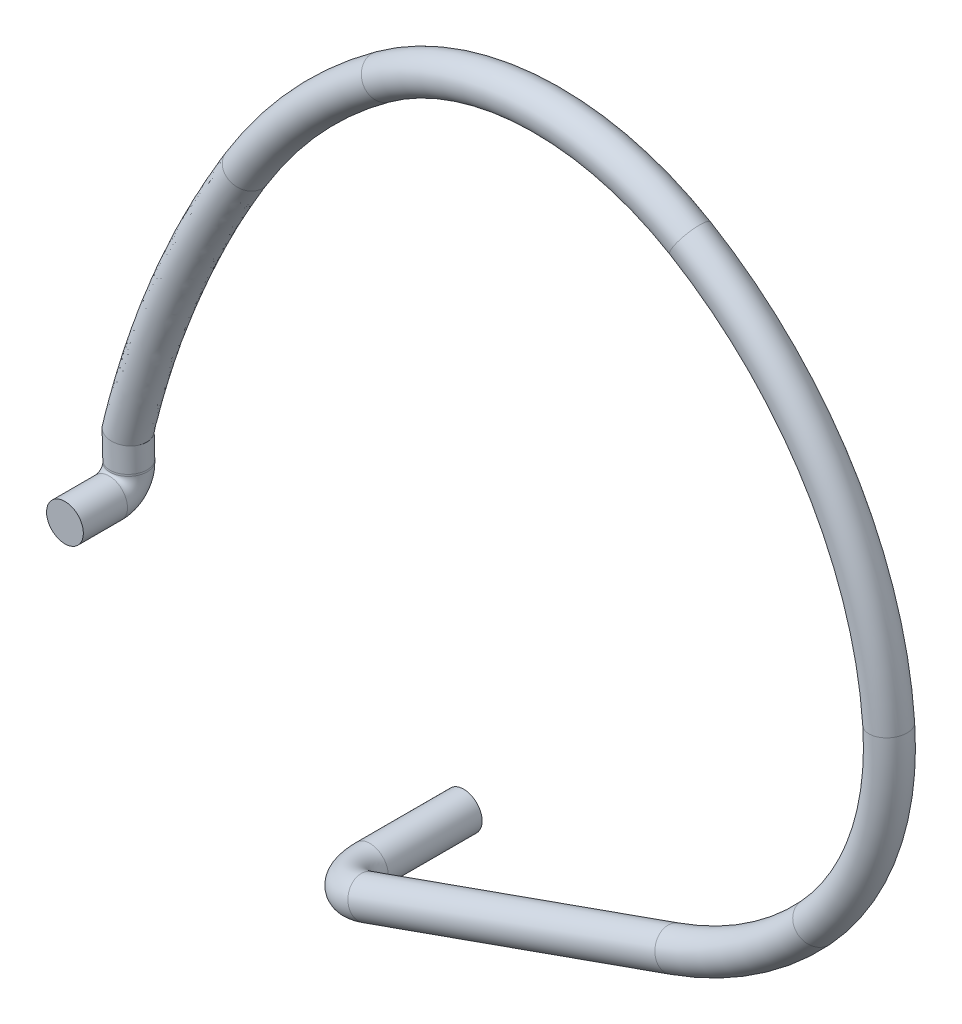
ISO-10303-21;
HEADER;
FILE_DESCRIPTION(('STEP AP214'),'2;1');
FILE_NAME('part.step','',(''),(''),'','','');
FILE_SCHEMA(('AUTOMOTIVE_DESIGN { 1 0 10303 214 1 1 1 1 }'));
ENDSEC;
DATA;
#1=APPLICATION_CONTEXT('core data for automotive mechanical design processes');
#2=APPLICATION_PROTOCOL_DEFINITION('international standard','automotive_design',2000,#1);
#3=PRODUCT_CONTEXT('',#1,'mechanical');
#4=PRODUCT('Part','Part','',(#3));
#5=PRODUCT_RELATED_PRODUCT_CATEGORY('part','',(#4));
#6=PRODUCT_DEFINITION_FORMATION('','',#4);
#7=PRODUCT_DEFINITION_CONTEXT('part definition',#1,'design');
#8=PRODUCT_DEFINITION('design','',#6,#7);
#9=PRODUCT_DEFINITION_SHAPE('','',#8);
#10=(LENGTH_UNIT() NAMED_UNIT(*) SI_UNIT(.MILLI.,.METRE.));
#11=(NAMED_UNIT(*) PLANE_ANGLE_UNIT() SI_UNIT($,.RADIAN.));
#12=(NAMED_UNIT(*) SI_UNIT($,.STERADIAN.) SOLID_ANGLE_UNIT());
#13=UNCERTAINTY_MEASURE_WITH_UNIT(LENGTH_MEASURE(1.E-05),#10,'distance_accuracy_value','');
#14=(GEOMETRIC_REPRESENTATION_CONTEXT(3) GLOBAL_UNCERTAINTY_ASSIGNED_CONTEXT((#13)) GLOBAL_UNIT_ASSIGNED_CONTEXT((#10,
#11,#12)) REPRESENTATION_CONTEXT('',''));
#15=CARTESIAN_POINT('',(0.,0.,0.));
#16=DIRECTION('',(0.,0.,1.));
#17=DIRECTION('',(1.,0.,0.));
#18=AXIS2_PLACEMENT_3D('',#15,#16,#17);
#19=CARTESIAN_POINT('',(-1.26943375651146,1.19294107246248,0.110000000000001));
#20=DIRECTION('',(0.,0.,1.));
#21=DIRECTION('',(1.,0.,0.));
#22=AXIS2_PLACEMENT_3D('',#19,#20,#21);
#23=CYLINDRICAL_SURFACE('',#22,0.0999999999999978);
#24=CARTESIAN_POINT('',(-1.26943375651146,1.19294107246248,0.110000000000001));
#25=DIRECTION('',(0.,0.,-1.));
#26=DIRECTION('',(-0.999662443856908,-0.0259807302059508,0.));
#27=AXIS2_PLACEMENT_3D('',#24,#25,#26);
#28=CIRCLE('',#27,0.0999999999999978);
#29=CARTESIAN_POINT('',(-1.26683568349087,1.09297482807679,0.110000000000002));
#30=VERTEX_POINT('',#29);
#31=EDGE_CURVE('E42',#30,#30,#28,.T.);
#32=ORIENTED_EDGE('',*,*,#31,.F.);
#33=EDGE_LOOP('',(#32));
#34=FACE_BOUND('',#33,.T.);
#35=CARTESIAN_POINT('',(-1.26943375651146,1.19294107246248,0.35));
#36=DIRECTION('',(0.,0.,-1.));
#37=DIRECTION('',(-0.999662443856908,-0.0259807302059508,0.));
#38=AXIS2_PLACEMENT_3D('',#35,#36,#37);
#39=CIRCLE('',#38,0.0999999999999978);
#40=CARTESIAN_POINT('',(-1.36940000089715,1.19034299944188,0.35));
#41=VERTEX_POINT('',#40);
#42=EDGE_CURVE('E11',#41,#41,#39,.T.);
#43=ORIENTED_EDGE('',*,*,#42,.T.);
#44=EDGE_LOOP('',(#43));
#45=FACE_BOUND('',#44,.T.);
#46=ADVANCED_FACE('F36',(#34,#45),#23,.T.);
#47=CARTESIAN_POINT('',(-1.27229461323826,1.30301846460529,0.11));
#48=DIRECTION('',(-0.999662443856908,-0.0259807302059508,0.));
#49=DIRECTION('',(0.0259807302059508,-0.999662443856908,0.));
#50=AXIS2_PLACEMENT_3D('',#47,#48,#49);
#51=TOROIDAL_SURFACE('',#50,0.110114561989662,0.0999999999999978);
#52=CARTESIAN_POINT('',(-1.27229461323826,1.3030184646053,-0.000114561989662156));
#53=DIRECTION('',(-0.0259807302059495,0.999662443856908,0.));
#54=DIRECTION('',(-0.999662443856908,-0.0259807302059495,0.));
#55=AXIS2_PLACEMENT_3D('',#52,#53,#54);
#56=CIRCLE('',#55,0.0999999999999978);
#57=CARTESIAN_POINT('',(-1.27229461323826,1.3030184646053,-0.10011456198966));
#58=VERTEX_POINT('',#57);
#59=EDGE_CURVE('E46',#58,#58,#56,.T.);
#60=CARTESIAN_POINT('',(-1.27229461323826,1.30301846460529,0.11));
#61=DIRECTION('',(-0.999662443856908,-0.0259807302059508,0.));
#62=DIRECTION('',(0.0259807302059508,-0.999662443856908,0.));
#63=AXIS2_PLACEMENT_3D('',#60,#61,#62);
#64=CIRCLE('',#63,0.21011456198966);
#65=EDGE_CURVE('',#58,#30,#64,.T.);
#66=ORIENTED_EDGE('',*,*,#59,.F.);
#67=ORIENTED_EDGE('',*,*,#31,.T.);
#68=ORIENTED_EDGE('',*,*,#65,.T.);
#69=ORIENTED_EDGE('',*,*,#65,.F.);
#70=EDGE_LOOP('',(#66,#68,#67,#69));
#71=FACE_BOUND('',#70,.T.);
#72=ADVANCED_FACE('F97',(#71),#51,.T.);
#73=CARTESIAN_POINT('',(-1.27253634184482,1.31231947376339,-0.000114561989662061));
#74=DIRECTION('',(0.0259807302059614,-0.999662443856908,0.));
#75=DIRECTION('',(0.999662443856908,0.0259807302059614,0.));
#76=AXIS2_PLACEMENT_3D('',#73,#74,#75);
#77=CYLINDRICAL_SURFACE('',#76,0.0999999999999978);
#78=CARTESIAN_POINT('',(-1.27253634184482,1.31231947376339,-0.000114561989662061));
#79=DIRECTION('',(-0.0259807302059495,0.999662443856908,0.));
#80=DIRECTION('',(-0.999662443856908,-0.0259807302059495,0.));
#81=AXIS2_PLACEMENT_3D('',#78,#79,#80);
#82=CIRCLE('',#81,0.0999999999999978);
#83=CARTESIAN_POINT('',(-1.37250258623051,1.30972140074279,-0.000114561989662061));
#84=VERTEX_POINT('',#83);
#85=EDGE_CURVE('E84',#84,#84,#82,.T.);
#86=ORIENTED_EDGE('',*,*,#85,.F.);
#87=EDGE_LOOP('',(#86));
#88=FACE_BOUND('',#87,.T.);
#89=ORIENTED_EDGE('',*,*,#59,.T.);
#90=EDGE_LOOP('',(#89));
#91=FACE_BOUND('',#90,.T.);
#92=ADVANCED_FACE('F93',(#88,#91),#77,.T.);
#93=CARTESIAN_POINT('',(1.75401515880903,1.53999070756492,-0.000114561989662061));
#94=DIRECTION('',(0.,0.,1.));
#95=DIRECTION('',(1.,0.,0.));
#96=AXIS2_PLACEMENT_3D('',#93,#94,#95);
#97=TOROIDAL_SURFACE('',#96,2.80000000000356,0.1);
#98=CARTESIAN_POINT('',(0.107557611958515,3.80475946980951,-0.000114561989662061));
#99=DIRECTION('',(0.808845986513773,0.588020552447413,0.));
#100=DIRECTION('',(0.196440073807942,-0.270211244536807,0.942548237878677));
#101=AXIS2_PLACEMENT_3D('',#98,#99,#100);
#102=CIRCLE('',#101,0.1);
#103=CARTESIAN_POINT('',(0.0487555567139279,3.885644068461,-0.000114561989662061));
#104=VERTEX_POINT('',#103);
#105=EDGE_CURVE('E50',#104,#104,#102,.T.);
#106=CARTESIAN_POINT('',(-0.633159127096336,3.00334265727904,-0.000114561989662061));
#107=DIRECTION('',(0.522625696324177,0.852562244966119,0.));
#108=DIRECTION('',(0.284815538555503,-0.174593608901182,0.942548237878677));
#109=AXIS2_PLACEMENT_3D('',#106,#107,#108);
#110=CIRCLE('',#109,0.1);
#111=CARTESIAN_POINT('',(-0.718415351592848,3.05560522691162,-0.000114561989662061));
#112=VERTEX_POINT('',#111);
#113=EDGE_CURVE('E74',#112,#112,#110,.T.);
#114=CARTESIAN_POINT('',(1.75401515880903,1.53999070756492,-0.000114561989662061));
#115=DIRECTION('',(0.,0.,1.));
#116=DIRECTION('',(1.,0.,0.));
#117=AXIS2_PLACEMENT_3D('',#114,#115,#116);
#118=CIRCLE('',#117,2.90000000000356);
#119=EDGE_CURVE('',#104,#112,#118,.T.);
#120=ORIENTED_EDGE('',*,*,#105,.F.);
#121=ORIENTED_EDGE('',*,*,#113,.T.);
#122=ORIENTED_EDGE('',*,*,#119,.T.);
#123=ORIENTED_EDGE('',*,*,#119,.F.);
#124=EDGE_LOOP('',(#120,#122,#121,#123));
#125=FACE_BOUND('',#124,.T.);
#126=ADVANCED_FACE('F96',(#125),#97,.T.);
#127=CARTESIAN_POINT('',(1.00134885167629,2.57531357030678,-0.000114561989662061));
#128=DIRECTION('',(0.,0.,1.));
#129=DIRECTION('',(1.,0.,0.));
#130=AXIS2_PLACEMENT_3D('',#127,#128,#129);
#131=TOROIDAL_SURFACE('',#130,1.5200000000001,0.1);
#132=CARTESIAN_POINT('',(1.77802987975059,3.88189941923894,-0.000114561989662061));
#133=DIRECTION('',(0.85959595324576,-0.510974360573516,0.));
#134=DIRECTION('',(-0.170701246218798,-0.287165290052871,0.942548237878677));
#135=AXIS2_PLACEMENT_3D('',#132,#133,#134);
#136=CIRCLE('',#135,0.1);
#137=CARTESIAN_POINT('',(1.82912731580811,3.96785901456341,-0.000114561989662061));
#138=VERTEX_POINT('',#137);
#139=EDGE_CURVE('E55',#138,#138,#136,.T.);
#140=CARTESIAN_POINT('',(1.00134885167629,2.57531357030678,-0.000114561989662061));
#141=DIRECTION('',(0.,0.,1.));
#142=DIRECTION('',(1.,0.,0.));
#143=AXIS2_PLACEMENT_3D('',#140,#141,#142);
#144=CIRCLE('',#143,1.6200000000001);
#145=EDGE_CURVE('',#138,#104,#144,.T.);
#146=ORIENTED_EDGE('',*,*,#139,.F.);
#147=ORIENTED_EDGE('',*,*,#105,.T.);
#148=ORIENTED_EDGE('',*,*,#145,.T.);
#149=ORIENTED_EDGE('',*,*,#145,.F.);
#150=EDGE_LOOP('',(#146,#148,#147,#149));
#151=FACE_BOUND('',#150,.T.);
#152=ADVANCED_FACE('F109',(#151),#131,.T.);
#153=CARTESIAN_POINT('',(0.643666799274295,1.97359640302815,-0.000114561989662061));
#154=DIRECTION('',(0.,0.,1.));
#155=DIRECTION('',(1.,0.,0.));
#156=AXIS2_PLACEMENT_3D('',#153,#154,#155);
#157=TOROIDAL_SURFACE('',#156,2.22000000000604,0.1);
#158=CARTESIAN_POINT('',(2.85785457566425,2.13413453218178,-0.000114561989662061));
#159=DIRECTION('',(0.0723144725915277,-0.997381881254021,0.));
#160=DIRECTION('',(-0.33319544623532,-0.0241581017434347,0.942548237878677));
#161=AXIS2_PLACEMENT_3D('',#158,#159,#160);
#162=CIRCLE('',#161,0.1);
#163=CARTESIAN_POINT('',(2.95759276378965,2.14136597944094,-0.000114561989662061));
#164=VERTEX_POINT('',#163);
#165=EDGE_CURVE('E58',#164,#164,#162,.T.);
#166=CARTESIAN_POINT('',(0.643666799274295,1.97359640302815,-0.000114561989662061));
#167=DIRECTION('',(0.,0.,1.));
#168=DIRECTION('',(1.,0.,0.));
#169=AXIS2_PLACEMENT_3D('',#166,#167,#168);
#170=CIRCLE('',#169,2.32000000000604);
#171=EDGE_CURVE('',#164,#138,#170,.T.);
#172=ORIENTED_EDGE('',*,*,#165,.F.);
#173=ORIENTED_EDGE('',*,*,#139,.T.);
#174=ORIENTED_EDGE('',*,*,#171,.T.);
#175=ORIENTED_EDGE('',*,*,#171,.F.);
#176=EDGE_LOOP('',(#172,#174,#173,#175));
#177=FACE_BOUND('',#176,.T.);
#178=ADVANCED_FACE('F113',(#177),#157,.T.);
#179=CARTESIAN_POINT('',(1.35180793496933,2.02493967856848,-0.000114561989662061));
#180=DIRECTION('',(0.,0.,1.));
#181=DIRECTION('',(1.,0.,0.));
#182=AXIS2_PLACEMENT_3D('',#179,#180,#181);
#183=TOROIDAL_SURFACE('',#182,1.51000000000135,0.1);
#184=CARTESIAN_POINT('',(2.46011325804326,0.999386505471118,-0.000114561989662061));
#185=DIRECTION('',(-0.679174286818835,-0.733977035147645,0.));
#186=DIRECTION('',(-0.245199767861234,0.226891809267318,0.942548237878677));
#187=AXIS2_PLACEMENT_3D('',#184,#185,#186);
#188=CIRCLE('',#187,0.1);
#189=CARTESIAN_POINT('',(2.53351096155803,0.931469076789235,-0.000114561989662061));
#190=VERTEX_POINT('',#189);
#191=EDGE_CURVE('E61',#190,#190,#188,.T.);
#192=CARTESIAN_POINT('',(1.35180793496933,2.02493967856848,-0.000114561989662061));
#193=DIRECTION('',(0.,0.,1.));
#194=DIRECTION('',(1.,0.,0.));
#195=AXIS2_PLACEMENT_3D('',#192,#193,#194);
#196=CIRCLE('',#195,1.61000000000135);
#197=EDGE_CURVE('',#190,#164,#196,.T.);
#198=ORIENTED_EDGE('',*,*,#191,.F.);
#199=ORIENTED_EDGE('',*,*,#165,.T.);
#200=ORIENTED_EDGE('',*,*,#197,.T.);
#201=ORIENTED_EDGE('',*,*,#197,.F.);
#202=EDGE_LOOP('',(#198,#200,#199,#201));
#203=FACE_BOUND('',#202,.T.);
#204=ADVANCED_FACE('F117',(#203),#183,.T.);
#205=CARTESIAN_POINT('',(1.05087735055879,2.3034011361642,-0.000114561989662061));
#206=DIRECTION('',(0.,0.,1.));
#207=DIRECTION('',(1.,0.,0.));
#208=AXIS2_PLACEMENT_3D('',#205,#206,#207);
#209=TOROIDAL_SURFACE('',#208,1.92000000000135,0.1);
#210=CARTESIAN_POINT('',(1.69229190680471,0.493708519435864,-0.000114561989662061));
#211=DIRECTION('',(-0.942548237878677,-0.334070081377845,0.));
#212=DIRECTION('',(-0.111602819271788,0.314877166530679,0.942548237878677));
#213=AXIS2_PLACEMENT_3D('',#210,#211,#212);
#214=CIRCLE('',#213,0.1);
#215=CARTESIAN_POINT('',(1.72569891494249,0.399453695647997,-0.000114561989662061));
#216=VERTEX_POINT('',#215);
#217=EDGE_CURVE('E64',#216,#216,#214,.T.);
#218=CARTESIAN_POINT('',(1.05087735055879,2.3034011361642,-0.000114561989662061));
#219=DIRECTION('',(0.,0.,1.));
#220=DIRECTION('',(1.,0.,0.));
#221=AXIS2_PLACEMENT_3D('',#218,#219,#220);
#222=CIRCLE('',#221,2.02000000000135);
#223=EDGE_CURVE('',#216,#190,#222,.T.);
#224=ORIENTED_EDGE('',*,*,#217,.F.);
#225=ORIENTED_EDGE('',*,*,#191,.T.);
#226=ORIENTED_EDGE('',*,*,#223,.T.);
#227=ORIENTED_EDGE('',*,*,#223,.F.);
#228=EDGE_LOOP('',(#224,#226,#225,#227));
#229=FACE_BOUND('',#228,.T.);
#230=ADVANCED_FACE('F121',(#229),#209,.T.);
#231=CARTESIAN_POINT('',(0.0239815257589993,-0.0975955246016457,-0.000114561989662061));
#232=DIRECTION('',(0.942548237878677,0.334070081377848,0.));
#233=DIRECTION('',(-0.334070081377848,0.942548237878677,0.));
#234=AXIS2_PLACEMENT_3D('',#231,#232,#233);
#235=CYLINDRICAL_SURFACE('',#234,0.1);
#236=CARTESIAN_POINT('',(0.0239815257589993,-0.0975955246016457,-0.000114561989662061));
#237=DIRECTION('',(-0.942548237878677,-0.334070081377845,0.));
#238=DIRECTION('',(-0.111602819271788,0.314877166530679,0.942548237878677));
#239=AXIS2_PLACEMENT_3D('',#236,#237,#238);
#240=CIRCLE('',#239,0.1);
#241=CARTESIAN_POINT('',(0.023981525759,-0.0975955246016454,0.099885438010338));
#242=VERTEX_POINT('',#241);
#243=EDGE_CURVE('E67',#242,#242,#240,.T.);
#244=ORIENTED_EDGE('',*,*,#243,.F.);
#245=EDGE_LOOP('',(#244));
#246=FACE_BOUND('',#245,.T.);
#247=ORIENTED_EDGE('',*,*,#217,.T.);
#248=EDGE_LOOP('',(#247));
#249=FACE_BOUND('',#248,.T.);
#250=ADVANCED_FACE('F125',(#246,#249),#235,.T.);
#251=CARTESIAN_POINT('',(0.0239815257589978,-0.0975955246016462,-0.24));
#252=DIRECTION('',(-0.334070081377845,0.942548237878677,0.));
#253=DIRECTION('',(-0.942548237878677,-0.334070081377845,0.));
#254=AXIS2_PLACEMENT_3D('',#251,#252,#253);
#255=TOROIDAL_SURFACE('',#254,0.239885438010338,0.1);
#256=CARTESIAN_POINT('',(-0.202122071130401,-0.17773407239912,-0.240000000000002));
#257=DIRECTION('',(0.,0.,-1.));
#258=DIRECTION('',(-1.,0.,0.));
#259=AXIS2_PLACEMENT_3D('',#256,#257,#258);
#260=CIRCLE('',#259,0.1);
#261=CARTESIAN_POINT('',(-0.296376894918269,-0.211141080536904,-0.240000000000002));
#262=VERTEX_POINT('',#261);
#263=EDGE_CURVE('E70',#262,#262,#260,.T.);
#264=CARTESIAN_POINT('',(0.0239815257589978,-0.0975955246016462,-0.24));
#265=DIRECTION('',(-0.334070081377845,0.942548237878677,0.));
#266=DIRECTION('',(-0.942548237878677,-0.334070081377845,0.));
#267=AXIS2_PLACEMENT_3D('',#264,#265,#266);
#268=CIRCLE('',#267,0.339885438010338);
#269=EDGE_CURVE('',#262,#242,#268,.T.);
#270=ORIENTED_EDGE('',*,*,#263,.F.);
#271=ORIENTED_EDGE('',*,*,#243,.T.);
#272=ORIENTED_EDGE('',*,*,#269,.T.);
#273=ORIENTED_EDGE('',*,*,#269,.F.);
#274=EDGE_LOOP('',(#270,#272,#271,#273));
#275=FACE_BOUND('',#274,.T.);
#276=ADVANCED_FACE('F129',(#275),#255,.T.);
#277=CARTESIAN_POINT('',(-0.202122071130401,-0.17773407239912,-0.240000000000002));
#278=DIRECTION('',(0.,0.,-1.));
#279=DIRECTION('',(-1.,0.,0.));
#280=AXIS2_PLACEMENT_3D('',#277,#278,#279);
#281=CYLINDRICAL_SURFACE('',#280,0.1);
#282=ORIENTED_EDGE('',*,*,#263,.T.);
#283=EDGE_LOOP('',(#282));
#284=FACE_BOUND('',#283,.T.);
#285=CARTESIAN_POINT('',(-0.202122071130401,-0.17773407239912,-0.75));
#286=DIRECTION('',(0.,0.,-1.));
#287=DIRECTION('',(-1.,0.,0.));
#288=AXIS2_PLACEMENT_3D('',#285,#286,#287);
#289=CIRCLE('',#288,0.1);
#290=CARTESIAN_POINT('',(-0.302122071130401,-0.17773407239912,-0.75));
#291=VERTEX_POINT('',#290);
#292=EDGE_CURVE('E71',#291,#291,#289,.T.);
#293=ORIENTED_EDGE('',*,*,#292,.F.);
#294=EDGE_LOOP('',(#293));
#295=FACE_BOUND('',#294,.T.);
#296=ADVANCED_FACE('F133',(#284,#295),#281,.T.);
#297=CARTESIAN_POINT('',(-0.202122071130401,-0.17773407239912,-0.75));
#298=DIRECTION('',(0.,0.,-1.));
#299=DIRECTION('',(-1.,0.,0.));
#300=AXIS2_PLACEMENT_3D('',#297,#298,#299);
#301=PLANE('',#300);
#302=ORIENTED_EDGE('',*,*,#292,.T.);
#303=EDGE_LOOP('',(#302));
#304=FACE_BOUND('',#303,.T.);
#305=ADVANCED_FACE('F137',(#304),#301,.T.);
#306=CARTESIAN_POINT('',(-0.604677573240787,2.98588329638892,0.0941402617982057));
#307=CARTESIAN_POINT('',(-0.686715961333953,2.85205361136233,0.0941402617982057));
#308=CARTESIAN_POINT('',(-0.836599321438284,2.58100355379748,0.0941402617982057));
#309=CARTESIAN_POINT('',(-1.06335218396806,2.07102327778885,0.0941402617982058));
#310=CARTESIAN_POINT('',(-1.18481175666154,1.69006949550249,0.0941402617982058));
#311=CARTESIAN_POINT('',(-1.24270007159211,1.45014505730142,0.0941402617982058));
#312=CARTESIAN_POINT('',(-0.443961364905845,2.88736331056083,0.0273262455226366));
#313=CARTESIAN_POINT('',(-0.528304369435835,2.74977409174748,0.0273262455226366));
#314=CARTESIAN_POINT('',(-0.66046499981198,2.51028852803427,0.0273262455226365));
#315=CARTESIAN_POINT('',(-0.881750399713355,2.01501996937177,0.0273262455226369));
#316=CARTESIAN_POINT('',(-0.994291861672939,1.67598131441745,0.0273262455226369));
#317=CARTESIAN_POINT('',(-1.05360693945326,1.43014350189234,0.0273262455226369));
#318=CARTESIAN_POINT('',(-0.500924472616946,2.92228203234106,-0.161183402053099));
#319=CARTESIAN_POINT('',(-0.585267477146936,2.78469281352772,-0.161183402053099));
#320=CARTESIAN_POINT('',(-0.722483031940531,2.53610588300431,-0.161183402053099));
#321=CARTESIAN_POINT('',(-0.94643809045754,2.03397212174155,-0.161183402053099));
#322=CARTESIAN_POINT('',(-1.06131268405948,1.68307052319708,-0.161183402053099));
#323=CARTESIAN_POINT('',(-1.1206277618398,1.43723271067197,-0.161183402053099));
#324=CARTESIAN_POINT('',(-0.661640680951887,3.02080201816915,-0.0943693857775298));
#325=CARTESIAN_POINT('',(-0.744831377263466,2.88509256624919,-0.0943693857775298));
#326=CARTESIAN_POINT('',(-0.898039300815048,2.60788405099717,-0.0943693857775298));
#327=CARTESIAN_POINT('',(-1.12849418968381,2.08870965984978,-0.0943693857775299));
#328=CARTESIAN_POINT('',(-1.25111919762321,1.70011539144414,-0.0943693857775299));
#329=CARTESIAN_POINT('',(-1.30972089397865,1.45723426608105,-0.0943693857775299));
#330=CARTESIAN_POINT('',(-0.822356889286829,3.11932200399725,-0.0275553695019608));
#331=CARTESIAN_POINT('',(-0.904395277379995,2.98549231897066,-0.0275553695019608));
#332=CARTESIAN_POINT('',(-1.07359556968956,2.67966221899002,-0.0275553695019606));
#333=CARTESIAN_POINT('',(-1.31055028891008,2.143447197958,-0.0275553695019611));
#334=CARTESIAN_POINT('',(-1.44092571118693,1.7171602596912,-0.0275553695019611));
#335=CARTESIAN_POINT('',(-1.4988140261175,1.47723582149012,-0.0275553695019611));
#336=CARTESIAN_POINT('',(-0.765393781575728,3.08440328221701,0.160954278073775));
#337=CARTESIAN_POINT('',(-0.845127553232071,2.95433313097718,0.160954278073775));
#338=CARTESIAN_POINT('',(-1.01273364306459,2.65171857956069,0.160954278073775));
#339=CARTESIAN_POINT('',(-1.24495396822277,2.12702658620594,0.160954278073775));
#340=CARTESIAN_POINT('',(-1.37533165165014,1.70415767658752,0.160954278073775));
#341=CARTESIAN_POINT('',(-1.43179320373096,1.47014661271049,0.160954278073775));
#342=CARTESIAN_POINT('',(-0.604677573240787,2.98588329638892,0.0941402617982057));
#343=CARTESIAN_POINT('',(-0.686715961333953,2.85205361136233,0.0941402617982057));
#344=CARTESIAN_POINT('',(-0.836599321438284,2.58100355379748,0.0941402617982057));
#345=CARTESIAN_POINT('',(-1.06335218396806,2.07102327778885,0.0941402617982058));
#346=CARTESIAN_POINT('',(-1.18481175666154,1.69006949550249,0.0941402617982058));
#347=CARTESIAN_POINT('',(-1.24270007159211,1.45014505730142,0.0941402617982058));
#348=(BOUNDED_SURFACE() B_SPLINE_SURFACE(3,3,((#306,#307,#308,#309,#310,#311),(#312,#313,#314,
#315,#316,#317),(#318,#319,#320,#321,#322,#323),(#324,#325,#326,#327,#328,#329),(#330,#331,#332,
#333,#334,#335),(#336,#337,#338,#339,#340,#341),(#342,#343,#344,#345,#346,#347)),.UNSPECIFIED.,
.T.,.F.,.F.) B_SPLINE_SURFACE_WITH_KNOTS((4,3,4),(4,1,1,4),(0.,0.5,1.),(0.,0.279671899333919,
0.560198205028559,1.),
.UNSPECIFIED.) GEOMETRIC_REPRESENTATION_ITEM() RATIONAL_B_SPLINE_SURFACE(((1.,1.,1.,1.,1.,1.),
(0.333333333333333,0.333333333333333,0.333333333333333,0.333333333333333,0.333333333333333,
0.333333333333333),(0.333333333333333,0.333333333333333,0.333333333333333,0.333333333333333,
0.333333333333333,0.333333333333333),(1.,1.,1.,1.,1.,1.),(0.333333333333333,0.333333333333333,
0.333333333333333,0.333333333333333,0.333333333333333,0.333333333333333),(0.333333333333333,
0.333333333333333,0.333333333333333,0.333333333333333,0.333333333333333,0.333333333333333),(1.,
1.,1.,1.,1.,1.))) REPRESENTATION_ITEM('') SURFACE());
#349=CARTESIAN_POINT('',(-1.24270007159211,1.45014505730142,0.0941402617982058));
#350=CARTESIAN_POINT('',(-1.05360693945326,1.43014350189234,0.0273262455226369));
#351=CARTESIAN_POINT('',(-1.1206277618398,1.43723271067197,-0.161183402053099));
#352=CARTESIAN_POINT('',(-1.30972089397865,1.45723426608105,-0.0943693857775299));
#353=CARTESIAN_POINT('',(-1.4988140261175,1.47723582149012,-0.0275553695019611));
#354=CARTESIAN_POINT('',(-1.43179320373096,1.47014661271049,0.160954278073775));
#355=CARTESIAN_POINT('',(-1.24270007159211,1.45014505730142,0.0941402617982058));
#356=(BOUNDED_CURVE() B_SPLINE_CURVE(3,(#349,#350,#351,#352,#353,#354,#355),.UNSPECIFIED.,.T.,
.F.) B_SPLINE_CURVE_WITH_KNOTS((4,3,4),(0.,0.5,1.),
.UNSPECIFIED.) CURVE() GEOMETRIC_REPRESENTATION_ITEM() RATIONAL_B_SPLINE_CURVE((1.,
0.333333333333333,0.333333333333333,1.,0.333333333333333,0.333333333333333,1.)) REPRESENTATION_ITEM(''));
#357=CARTESIAN_POINT('',(-1.24270007159211,1.45014505730142,0.0941402617982058));
#358=VERTEX_POINT('',#357);
#359=EDGE_CURVE('E79',#358,#358,#356,.F.);
#360=ORIENTED_EDGE('',*,*,#113,.F.);
#361=EDGE_LOOP('',(#360));
#362=FACE_BOUND('',#361,.T.);
#363=ORIENTED_EDGE('',*,*,#359,.F.);
#364=EDGE_LOOP('',(#363));
#365=FACE_BOUND('',#364,.T.);
#366=ADVANCED_FACE('F141',(#362,#365),#348,.F.);
#367=CARTESIAN_POINT('',(-1.30038067876098,1.09785012650398,0.350000000000001));
#368=DIRECTION('',(0.,0.,-1.));
#369=DIRECTION('',(-0.999662443856908,-0.0259807302059508,0.));
#370=AXIS2_PLACEMENT_3D('',#367,#368,#369);
#371=PLANE('',#370);
#372=ORIENTED_EDGE('',*,*,#42,.F.);
#373=EDGE_LOOP('',(#372));
#374=FACE_BOUND('',#373,.T.);
#375=ADVANCED_FACE('F147',(#374),#371,.F.);
#376=CARTESIAN_POINT('',(-1.24270007159211,1.45014505730131,0.0941402617982058));
#377=CARTESIAN_POINT('',(-1.23914061044786,1.3131874122288,0.0941402617982058));
#378=CARTESIAN_POINT('',(-1.43179320373096,1.47014661271039,0.160954278073775));
#379=CARTESIAN_POINT('',(-1.42758662543399,1.30828979393392,0.160954278073775));
#380=CARTESIAN_POINT('',(-1.4988140261175,1.47723582149001,-0.0275553695019611));
#381=CARTESIAN_POINT('',(-1.4943780882279,1.30655391700309,-0.0275553695019611));
#382=CARTESIAN_POINT('',(-1.30972089397865,1.45723426608094,-0.0943693857775299));
#383=CARTESIAN_POINT('',(-1.30593207324178,1.31145153529797,-0.0943693857775299));
#384=CARTESIAN_POINT('',(-1.1206277618398,1.43723271067186,-0.161183402053099));
#385=CARTESIAN_POINT('',(-1.11748605825565,1.31634915359286,-0.161183402053099));
#386=CARTESIAN_POINT('',(-1.05360693945326,1.43014350189223,0.0273262455226369));
#387=CARTESIAN_POINT('',(-1.05069459546173,1.31808503052369,0.0273262455226369));
#388=CARTESIAN_POINT('',(-1.24270007159211,1.45014505730131,0.0941402617982058));
#389=CARTESIAN_POINT('',(-1.23914061044786,1.3131874122288,0.0941402617982058));
#390=(BOUNDED_SURFACE() B_SPLINE_SURFACE(3,1,((#376,#377),(#378,#379),(#380,#381),(#382,#383),
(#384,#385),(#386,#387),(#388,#389)),.UNSPECIFIED.,.T.,.F.,.F.) B_SPLINE_SURFACE_WITH_KNOTS((4,
3,4),(2,2),(0.,0.5,1.),(0.,1.),
.UNSPECIFIED.) GEOMETRIC_REPRESENTATION_ITEM() RATIONAL_B_SPLINE_SURFACE(((1.,1.),
(0.333333333333333,0.333333333333333),(0.333333333333333,0.333333333333333),(1.,1.),
(0.333333333333333,0.333333333333333),(0.333333333333333,0.333333333333333),(1.,1.))) REPRESENTATION_ITEM('') SURFACE());
#391=ORIENTED_EDGE('',*,*,#359,.T.);
#392=EDGE_LOOP('',(#391));
#393=FACE_BOUND('',#392,.T.);
#394=ORIENTED_EDGE('',*,*,#85,.T.);
#395=EDGE_LOOP('',(#394));
#396=FACE_BOUND('',#395,.T.);
#397=ADVANCED_FACE('F91',(#393,#396),#390,.T.);
#398=CLOSED_SHELL('',(#46,#72,#92,#126,#152,#178,#204,#230,#250,#276,#296,#305,#366,#375,#397));
#399=MANIFOLD_SOLID_BREP('B2',#398);
#400=ADVANCED_BREP_SHAPE_REPRESENTATION('',(#18,#399),#14);
#401=SHAPE_DEFINITION_REPRESENTATION(#9,#400);
ENDSEC;
END-ISO-10303-21;
